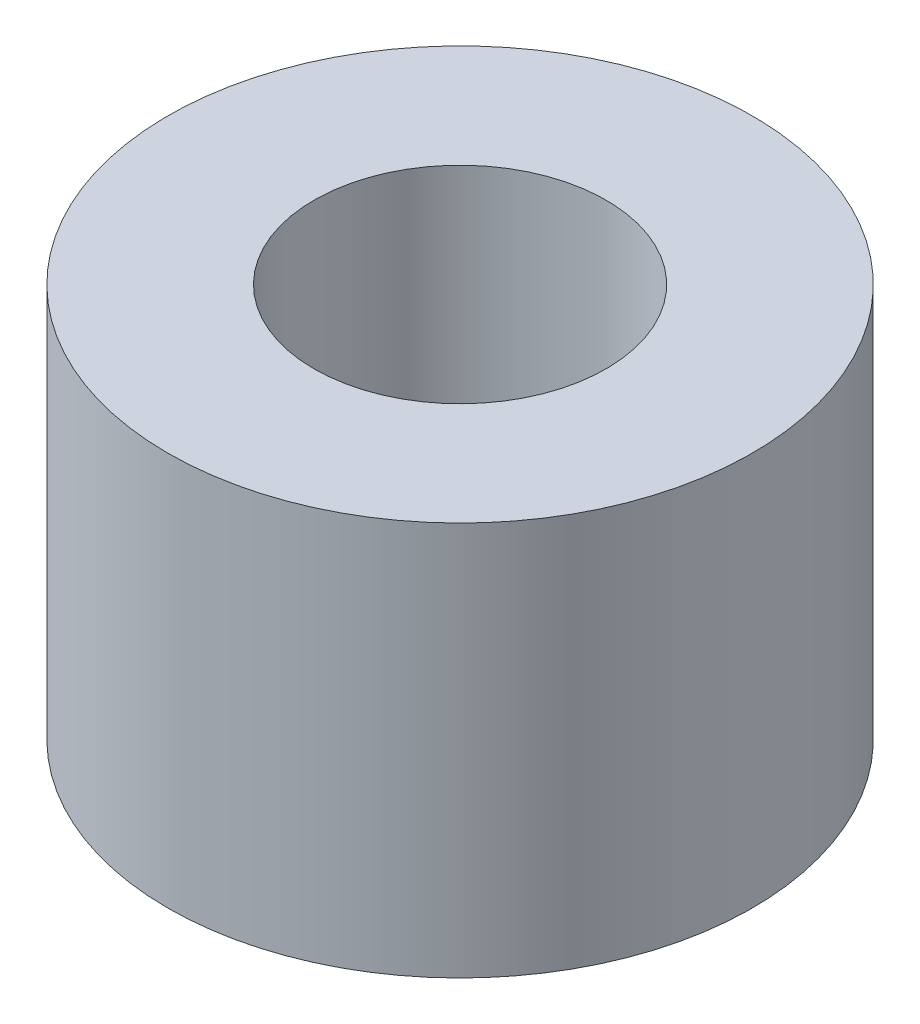
ISO-10303-21;
HEADER;
FILE_DESCRIPTION(('STEP AP214'),'2;1');
FILE_NAME('part.step','',(''),(''),'','','');
FILE_SCHEMA(('AUTOMOTIVE_DESIGN { 1 0 10303 214 1 1 1 1 }'));
ENDSEC;
DATA;
#1=APPLICATION_CONTEXT('core data for automotive mechanical design processes');
#2=APPLICATION_PROTOCOL_DEFINITION('international standard','automotive_design',2000,#1);
#3=PRODUCT_CONTEXT('',#1,'mechanical');
#4=PRODUCT('Part','Part','',(#3));
#5=PRODUCT_RELATED_PRODUCT_CATEGORY('part','',(#4));
#6=PRODUCT_DEFINITION_FORMATION('','',#4);
#7=PRODUCT_DEFINITION_CONTEXT('part definition',#1,'design');
#8=PRODUCT_DEFINITION('design','',#6,#7);
#9=PRODUCT_DEFINITION_SHAPE('','',#8);
#10=(LENGTH_UNIT() NAMED_UNIT(*) SI_UNIT(.MILLI.,.METRE.));
#11=(NAMED_UNIT(*) PLANE_ANGLE_UNIT() SI_UNIT($,.RADIAN.));
#12=(NAMED_UNIT(*) SI_UNIT($,.STERADIAN.) SOLID_ANGLE_UNIT());
#13=UNCERTAINTY_MEASURE_WITH_UNIT(LENGTH_MEASURE(1.E-05),#10,'distance_accuracy_value','');
#14=(GEOMETRIC_REPRESENTATION_CONTEXT(3) GLOBAL_UNCERTAINTY_ASSIGNED_CONTEXT((#13)) GLOBAL_UNIT_ASSIGNED_CONTEXT((#10,
#11,#12)) REPRESENTATION_CONTEXT('',''));
#15=CARTESIAN_POINT('',(0.,0.,0.));
#16=DIRECTION('',(0.,0.,1.));
#17=DIRECTION('',(1.,0.,0.));
#18=AXIS2_PLACEMENT_3D('',#15,#16,#17);
#19=CARTESIAN_POINT('',(0.,8.56234,0.));
#20=DIRECTION('',(0.,1.,0.));
#21=DIRECTION('',(0.,0.,1.));
#22=AXIS2_PLACEMENT_3D('',#19,#20,#21);
#23=PLANE('',#22);
#24=CARTESIAN_POINT('',(0.,8.56234,0.));
#25=DIRECTION('',(0.,1.,0.));
#26=DIRECTION('',(0.,0.,1.));
#27=AXIS2_PLACEMENT_3D('',#24,#25,#26);
#28=CIRCLE('',#27,6.35);
#29=CARTESIAN_POINT('',(0.,8.56234,6.35));
#30=VERTEX_POINT('',#29);
#31=EDGE_CURVE('E10',#30,#30,#28,.T.);
#32=ORIENTED_EDGE('',*,*,#31,.T.);
#33=EDGE_LOOP('',(#32));
#34=FACE_BOUND('',#33,.T.);
#35=CARTESIAN_POINT('',(0.,8.56234,0.));
#36=DIRECTION('',(0.,1.,0.));
#37=DIRECTION('',(0.,0.,1.));
#38=AXIS2_PLACEMENT_3D('',#35,#36,#37);
#39=CIRCLE('',#38,3.175);
#40=CARTESIAN_POINT('',(0.,8.56234,3.175));
#41=VERTEX_POINT('',#40);
#42=EDGE_CURVE('E48',#41,#41,#39,.T.);
#43=ORIENTED_EDGE('',*,*,#42,.F.);
#44=EDGE_LOOP('',(#43));
#45=FACE_BOUND('',#44,.T.);
#46=ADVANCED_FACE('F34',(#34,#45),#23,.T.);
#47=CARTESIAN_POINT('',(0.,0.,0.));
#48=DIRECTION('',(0.,1.,0.));
#49=DIRECTION('',(0.,0.,1.));
#50=AXIS2_PLACEMENT_3D('',#47,#48,#49);
#51=PLANE('',#50);
#52=CARTESIAN_POINT('',(0.,0.,0.));
#53=DIRECTION('',(0.,1.,0.));
#54=DIRECTION('',(0.,0.,1.));
#55=AXIS2_PLACEMENT_3D('',#52,#53,#54);
#56=CIRCLE('',#55,6.35);
#57=CARTESIAN_POINT('',(0.,0.,6.35));
#58=VERTEX_POINT('',#57);
#59=EDGE_CURVE('E38',#58,#58,#56,.T.);
#60=ORIENTED_EDGE('',*,*,#59,.F.);
#61=EDGE_LOOP('',(#60));
#62=FACE_BOUND('',#61,.T.);
#63=CARTESIAN_POINT('',(0.,0.,0.));
#64=DIRECTION('',(0.,1.,0.));
#65=DIRECTION('',(0.,0.,1.));
#66=AXIS2_PLACEMENT_3D('',#63,#64,#65);
#67=CIRCLE('',#66,3.175);
#68=CARTESIAN_POINT('',(0.,0.,3.175));
#69=VERTEX_POINT('',#68);
#70=EDGE_CURVE('E50',#69,#69,#67,.T.);
#71=ORIENTED_EDGE('',*,*,#70,.T.);
#72=EDGE_LOOP('',(#71));
#73=FACE_BOUND('',#72,.T.);
#74=ADVANCED_FACE('F61',(#62,#73),#51,.F.);
#75=CARTESIAN_POINT('',(0.,8.56234,0.));
#76=DIRECTION('',(0.,-1.,0.));
#77=DIRECTION('',(0.,0.,-1.));
#78=AXIS2_PLACEMENT_3D('',#75,#76,#77);
#79=CYLINDRICAL_SURFACE('',#78,6.35);
#80=ORIENTED_EDGE('',*,*,#31,.F.);
#81=EDGE_LOOP('',(#80));
#82=FACE_BOUND('',#81,.T.);
#83=ORIENTED_EDGE('',*,*,#59,.T.);
#84=EDGE_LOOP('',(#83));
#85=FACE_BOUND('',#84,.T.);
#86=ADVANCED_FACE('F36',(#82,#85),#79,.T.);
#87=CARTESIAN_POINT('',(0.,8.56234,0.));
#88=DIRECTION('',(0.,-1.,0.));
#89=DIRECTION('',(0.,0.,-1.));
#90=AXIS2_PLACEMENT_3D('',#87,#88,#89);
#91=CYLINDRICAL_SURFACE('',#90,3.175);
#92=ORIENTED_EDGE('',*,*,#42,.T.);
#93=EDGE_LOOP('',(#92));
#94=FACE_BOUND('',#93,.T.);
#95=ORIENTED_EDGE('',*,*,#70,.F.);
#96=EDGE_LOOP('',(#95));
#97=FACE_BOUND('',#96,.T.);
#98=ADVANCED_FACE('F57',(#94,#97),#91,.F.);
#99=CLOSED_SHELL('',(#46,#74,#86,#98));
#100=MANIFOLD_SOLID_BREP('B2',#99);
#101=ADVANCED_BREP_SHAPE_REPRESENTATION('',(#18,#100),#14);
#102=SHAPE_DEFINITION_REPRESENTATION(#9,#101);
ENDSEC;
END-ISO-10303-21;
